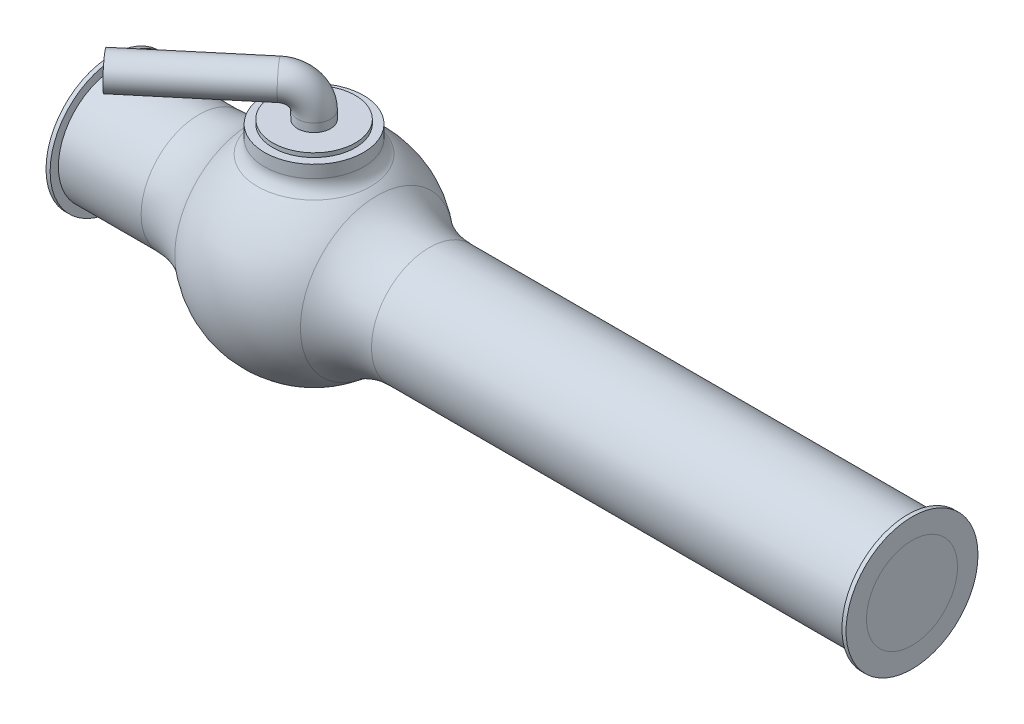
ISO-10303-21;
HEADER;
FILE_DESCRIPTION(('STEP AP214'),'2;1');
FILE_NAME('part.step','',(''),(''),'','','');
FILE_SCHEMA(('AUTOMOTIVE_DESIGN { 1 0 10303 214 1 1 1 1 }'));
ENDSEC;
DATA;
#1=APPLICATION_CONTEXT('core data for automotive mechanical design processes');
#2=APPLICATION_PROTOCOL_DEFINITION('international standard','automotive_design',2000,#1);
#3=PRODUCT_CONTEXT('',#1,'mechanical');
#4=PRODUCT('Part','Part','',(#3));
#5=PRODUCT_RELATED_PRODUCT_CATEGORY('part','',(#4));
#6=PRODUCT_DEFINITION_FORMATION('','',#4);
#7=PRODUCT_DEFINITION_CONTEXT('part definition',#1,'design');
#8=PRODUCT_DEFINITION('design','',#6,#7);
#9=PRODUCT_DEFINITION_SHAPE('','',#8);
#10=(LENGTH_UNIT() NAMED_UNIT(*) SI_UNIT(.MILLI.,.METRE.));
#11=(NAMED_UNIT(*) PLANE_ANGLE_UNIT() SI_UNIT($,.RADIAN.));
#12=(NAMED_UNIT(*) SI_UNIT($,.STERADIAN.) SOLID_ANGLE_UNIT());
#13=UNCERTAINTY_MEASURE_WITH_UNIT(LENGTH_MEASURE(1.E-05),#10,'distance_accuracy_value','');
#14=(GEOMETRIC_REPRESENTATION_CONTEXT(3) GLOBAL_UNCERTAINTY_ASSIGNED_CONTEXT((#13)) GLOBAL_UNIT_ASSIGNED_CONTEXT((#10,
#11,#12)) REPRESENTATION_CONTEXT('',''));
#15=CARTESIAN_POINT('',(0.,0.,0.));
#16=DIRECTION('',(0.,0.,1.));
#17=DIRECTION('',(1.,0.,0.));
#18=AXIS2_PLACEMENT_3D('',#15,#16,#17);
#19=CARTESIAN_POINT('',(0.,0.,0.));
#20=DIRECTION('',(0.,1.,0.));
#21=DIRECTION('',(0.,0.,-1.));
#22=AXIS2_PLACEMENT_3D('',#19,#20,#21);
#23=SPHERICAL_SURFACE('',#22,120.);
#24=CARTESIAN_POINT('',(0.,98.4782167977948,0.));
#25=DIRECTION('',(0.,-1.,0.));
#26=DIRECTION('',(0.,0.,-1.));
#27=AXIS2_PLACEMENT_3D('',#24,#25,#26);
#28=CIRCLE('',#27,68.5714285714286);
#29=CARTESIAN_POINT('',(0.,98.4782167977948,-68.5714285714286));
#30=VERTEX_POINT('',#29);
#31=EDGE_CURVE('P0_E11',#30,#30,#28,.T.);
#32=ORIENTED_EDGE('',*,*,#31,.T.);
#33=EDGE_LOOP('',(#32));
#34=FACE_BOUND('',#33,.T.);
#35=CARTESIAN_POINT('',(76.1685820569215,0.,0.));
#36=DIRECTION('',(-1.,0.,0.));
#37=DIRECTION('',(0.,0.,1.));
#38=AXIS2_PLACEMENT_3D('',#35,#36,#37);
#39=CIRCLE('',#38,92.7272727272727);
#40=CARTESIAN_POINT('',(76.1685820569215,0.,92.7272727272727));
#41=VERTEX_POINT('',#40);
#42=EDGE_CURVE('P0_E88',#41,#41,#39,.T.);
#43=ORIENTED_EDGE('',*,*,#42,.T.);
#44=EDGE_LOOP('',(#43));
#45=FACE_BOUND('',#44,.T.);
#46=CARTESIAN_POINT('',(-76.1685820569215,0.,0.));
#47=DIRECTION('',(1.,0.,0.));
#48=DIRECTION('',(0.,0.,-1.));
#49=AXIS2_PLACEMENT_3D('',#46,#47,#48);
#50=CIRCLE('',#49,92.7272727272727);
#51=CARTESIAN_POINT('',(-76.1685820569215,0.,-92.7272727272727));
#52=VERTEX_POINT('',#51);
#53=EDGE_CURVE('P0_E81',#52,#52,#50,.T.);
#54=ORIENTED_EDGE('',*,*,#53,.T.);
#55=EDGE_LOOP('',(#54));
#56=FACE_BOUND('',#55,.T.);
#57=ADVANCED_FACE('P0_F32',(#34,#45,#56),#23,.T.);
#58=CARTESIAN_POINT('',(0.,0.,0.));
#59=DIRECTION('',(0.,1.,0.));
#60=DIRECTION('',(0.,0.,-1.));
#61=AXIS2_PLACEMENT_3D('',#58,#59,#60);
#62=SPHERICAL_SURFACE('',#61,100.);
#63=CARTESIAN_POINT('',(-83.3885822273715,0.,0.));
#64=DIRECTION('',(1.,0.,0.));
#65=DIRECTION('',(0.,0.,-1.));
#66=AXIS2_PLACEMENT_3D('',#63,#64,#65);
#67=CIRCLE('',#66,55.1936985);
#68=CARTESIAN_POINT('',(-83.3885822273715,-46.099495348784,30.3509618084227));
#69=VERTEX_POINT('',#68);
#70=CARTESIAN_POINT('',(-83.3885822273715,46.0994953487841,30.3509618084227));
#71=VERTEX_POINT('',#70);
#72=EDGE_CURVE('P0_E46',#69,#71,#67,.F.);
#73=ORIENTED_EDGE('',*,*,#72,.T.);
#74=CARTESIAN_POINT('',(-63.879360034848,0.,53.6011474450814));
#75=DIRECTION('',(0.766044443118979,0.,-0.642787609686538));
#76=DIRECTION('',(-0.642787609686538,0.,-0.766044443118979));
#77=AXIS2_PLACEMENT_3D('',#74,#75,#76);
#78=CIRCLE('',#77,55.1936985);
#79=EDGE_CURVE('P0_E68',#71,#69,#78,.T.);
#80=ORIENTED_EDGE('',*,*,#79,.T.);
#81=EDGE_LOOP('',(#73,#80));
#82=FACE_BOUND('',#81,.T.);
#83=ADVANCED_FACE('P0_F76',(#82),#62,.F.);
#84=CARTESIAN_POINT('',(0.,135.,0.));
#85=DIRECTION('',(0.,1.,0.));
#86=DIRECTION('',(0.,0.,1.));
#87=AXIS2_PLACEMENT_3D('',#84,#85,#86);
#88=PLANE('',#87);
#89=CARTESIAN_POINT('',(0.,135.,0.));
#90=DIRECTION('',(0.,1.,0.));
#91=DIRECTION('',(0.,0.,1.));
#92=AXIS2_PLACEMENT_3D('',#89,#90,#91);
#93=CIRCLE('',#92,50.);
#94=CARTESIAN_POINT('',(0.,135.,50.));
#95=VERTEX_POINT('',#94);
#96=EDGE_CURVE('P0_E195',#95,#95,#93,.T.);
#97=ORIENTED_EDGE('',*,*,#96,.T.);
#98=EDGE_LOOP('',(#97));
#99=FACE_BOUND('',#98,.T.);
#100=CARTESIAN_POINT('',(0.,135.,0.));
#101=DIRECTION('',(0.,1.,0.));
#102=DIRECTION('',(0.,0.,1.));
#103=AXIS2_PLACEMENT_3D('',#100,#101,#102);
#104=CIRCLE('',#103,20.);
#105=CARTESIAN_POINT('',(0.,135.,20.));
#106=VERTEX_POINT('',#105);
#107=EDGE_CURVE('P0_E184',#106,#106,#104,.T.);
#108=ORIENTED_EDGE('',*,*,#107,.F.);
#109=EDGE_LOOP('',(#108));
#110=FACE_BOUND('',#109,.T.);
#111=ADVANCED_FACE('P0_F114',(#99,#110),#88,.T.);
#112=CARTESIAN_POINT('',(0.,135.,0.));
#113=DIRECTION('',(0.,-1.,0.));
#114=DIRECTION('',(0.,0.,-1.));
#115=AXIS2_PLACEMENT_3D('',#112,#113,#114);
#116=CYLINDRICAL_SURFACE('',#115,50.);
#117=ORIENTED_EDGE('',*,*,#96,.F.);
#118=EDGE_LOOP('',(#117));
#119=FACE_BOUND('',#118,.T.);
#120=CARTESIAN_POINT('',(0.,130.,0.));
#121=DIRECTION('',(0.,1.,0.));
#122=DIRECTION('',(0.,0.,1.));
#123=AXIS2_PLACEMENT_3D('',#120,#121,#122);
#124=CIRCLE('',#123,50.);
#125=CARTESIAN_POINT('',(0.,130.,50.));
#126=VERTEX_POINT('',#125);
#127=EDGE_CURVE('P0_E181',#126,#126,#124,.T.);
#128=ORIENTED_EDGE('',*,*,#127,.T.);
#129=EDGE_LOOP('',(#128));
#130=FACE_BOUND('',#129,.T.);
#131=ADVANCED_FACE('P0_F142',(#119,#130),#116,.T.);
#132=CARTESIAN_POINT('',(-22.9813332935695,175.,19.2836282905961));
#133=DIRECTION('',(-0.766044443118981,0.,0.642787609686535));
#134=DIRECTION('',(0.642787609686535,0.,0.766044443118982));
#135=AXIS2_PLACEMENT_3D('',#132,#133,#134);
#136=CYLINDRICAL_SURFACE('',#135,20.);
#137=CARTESIAN_POINT('',(-22.9813332935695,175.,19.2836282905961));
#138=DIRECTION('',(-0.766044443118982,0.,0.642787609686535));
#139=DIRECTION('',(0.492403876506103,-0.642787609686535,0.586824088833471));
#140=AXIS2_PLACEMENT_3D('',#137,#138,#139);
#141=CIRCLE('',#140,20.);
#142=CARTESIAN_POINT('',(-22.9813332935695,195.,19.2836282905961));
#143=VERTEX_POINT('',#142);
#144=EDGE_CURVE('P0_E188',#143,#143,#141,.T.);
#145=ORIENTED_EDGE('',*,*,#144,.T.);
#146=EDGE_LOOP('',(#145));
#147=FACE_BOUND('',#146,.T.);
#148=CARTESIAN_POINT('',(-137.887999761417,175.,115.701769743576));
#149=DIRECTION('',(-0.766044443118982,0.,0.642787609686535));
#150=DIRECTION('',(0.492403876506103,-0.642787609686535,0.586824088833471));
#151=AXIS2_PLACEMENT_3D('',#148,#149,#150);
#152=CIRCLE('',#151,20.);
#153=CARTESIAN_POINT('',(-128.039922231295,162.144247806269,127.438251520246));
#154=VERTEX_POINT('',#153);
#155=EDGE_CURVE('P0_E193',#154,#154,#152,.T.);
#156=ORIENTED_EDGE('',*,*,#155,.F.);
#157=EDGE_LOOP('',(#156));
#158=FACE_BOUND('',#157,.T.);
#159=ADVANCED_FACE('P0_F138',(#147,#158),#136,.T.);
#160=CARTESIAN_POINT('',(-22.9813332935694,145.,19.2836282905961));
#161=DIRECTION('',(0.642787609686535,0.,0.766044443118982));
#162=DIRECTION('',(0.766044443118982,0.,-0.642787609686535));
#163=AXIS2_PLACEMENT_3D('',#160,#161,#162);
#164=TOROIDAL_SURFACE('',#163,30.,20.);
#165=CARTESIAN_POINT('',(0.,145.,0.));
#166=DIRECTION('',(0.,1.,0.));
#167=DIRECTION('',(0.,0.,1.));
#168=AXIS2_PLACEMENT_3D('',#165,#166,#167);
#169=CIRCLE('',#168,20.);
#170=CARTESIAN_POINT('',(15.3208888623796,145.,-12.8557521937307));
#171=VERTEX_POINT('',#170);
#172=EDGE_CURVE('P0_E185',#171,#171,#169,.T.);
#173=CARTESIAN_POINT('',(-22.9813332935694,145.,19.2836282905961));
#174=DIRECTION('',(0.642787609686535,0.,0.766044443118982));
#175=DIRECTION('',(0.766044443118982,0.,-0.642787609686535));
#176=AXIS2_PLACEMENT_3D('',#173,#174,#175);
#177=CIRCLE('',#176,50.);
#178=EDGE_CURVE('',#171,#143,#177,.T.);
#179=ORIENTED_EDGE('',*,*,#172,.T.);
#180=ORIENTED_EDGE('',*,*,#144,.F.);
#181=ORIENTED_EDGE('',*,*,#178,.T.);
#182=ORIENTED_EDGE('',*,*,#178,.F.);
#183=EDGE_LOOP('',(#179,#181,#180,#182));
#184=FACE_BOUND('',#183,.T.);
#185=ADVANCED_FACE('P0_F134',(#184),#164,.T.);
#186=CARTESIAN_POINT('',(0.,145.,0.));
#187=DIRECTION('',(0.,-1.,0.));
#188=DIRECTION('',(0.,0.,-1.));
#189=AXIS2_PLACEMENT_3D('',#186,#187,#188);
#190=CYLINDRICAL_SURFACE('',#189,20.);
#191=ORIENTED_EDGE('',*,*,#172,.F.);
#192=EDGE_LOOP('',(#191));
#193=FACE_BOUND('',#192,.T.);
#194=ORIENTED_EDGE('',*,*,#107,.T.);
#195=EDGE_LOOP('',(#194));
#196=FACE_BOUND('',#195,.T.);
#197=ADVANCED_FACE('P0_F130',(#193,#196),#190,.T.);
#198=CARTESIAN_POINT('',(-137.887999761417,175.,115.701769743576));
#199=DIRECTION('',(-0.766044443118982,0.,0.642787609686535));
#200=DIRECTION('',(0.492403876506103,-0.642787609686535,0.586824088833471));
#201=AXIS2_PLACEMENT_3D('',#198,#199,#200);
#202=PLANE('',#201);
#203=ORIENTED_EDGE('',*,*,#155,.T.);
#204=EDGE_LOOP('',(#203));
#205=FACE_BOUND('',#204,.T.);
#206=ADVANCED_FACE('P0_F123',(#205),#202,.T.);
#207=CARTESIAN_POINT('',(0.,180.,0.));
#208=DIRECTION('',(0.,1.,0.));
#209=DIRECTION('',(0.,0.,1.));
#210=AXIS2_PLACEMENT_3D('',#207,#208,#209);
#211=CYLINDRICAL_SURFACE('',#210,60.);
#212=CARTESIAN_POINT('',(0.,114.891252930761,0.));
#213=DIRECTION('',(0.,-1.,0.));
#214=DIRECTION('',(0.,0.,-1.));
#215=AXIS2_PLACEMENT_3D('',#212,#213,#214);
#216=CIRCLE('',#215,60.);
#217=CARTESIAN_POINT('',(0.,114.891252930761,-60.));
#218=VERTEX_POINT('',#217);
#219=EDGE_CURVE('P0_E40',#218,#218,#216,.F.);
#220=ORIENTED_EDGE('',*,*,#219,.T.);
#221=EDGE_LOOP('',(#220));
#222=FACE_BOUND('',#221,.T.);
#223=CARTESIAN_POINT('',(0.,130.,0.));
#224=DIRECTION('',(0.,1.,0.));
#225=DIRECTION('',(0.,0.,1.));
#226=AXIS2_PLACEMENT_3D('',#223,#224,#225);
#227=CIRCLE('',#226,60.);
#228=CARTESIAN_POINT('',(0.,130.,60.));
#229=VERTEX_POINT('',#228);
#230=EDGE_CURVE('P0_E178',#229,#229,#227,.T.);
#231=ORIENTED_EDGE('',*,*,#230,.F.);
#232=EDGE_LOOP('',(#231));
#233=FACE_BOUND('',#232,.T.);
#234=ADVANCED_FACE('P0_F96',(#222,#233),#211,.T.);
#235=CARTESIAN_POINT('',(0.,130.,-40.));
#236=DIRECTION('',(0.,1.,0.));
#237=DIRECTION('',(0.,0.,1.));
#238=AXIS2_PLACEMENT_3D('',#235,#236,#237);
#239=PLANE('',#238);
#240=ORIENTED_EDGE('',*,*,#230,.T.);
#241=EDGE_LOOP('',(#240));
#242=FACE_BOUND('',#241,.T.);
#243=ORIENTED_EDGE('',*,*,#127,.F.);
#244=EDGE_LOOP('',(#243));
#245=FACE_BOUND('',#244,.T.);
#246=ADVANCED_FACE('P0_F122',(#242,#245),#239,.T.);
#247=CARTESIAN_POINT('',(-150.744751955147,0.,0.));
#248=DIRECTION('',(1.,0.,0.));
#249=DIRECTION('',(0.,0.,-1.));
#250=AXIS2_PLACEMENT_3D('',#247,#248,#249);
#251=CYLINDRICAL_SURFACE('',#250,70.);
#252=CARTESIAN_POINT('',(139.642400437689,0.,0.));
#253=DIRECTION('',(-1.,0.,0.));
#254=DIRECTION('',(0.,0.,1.));
#255=AXIS2_PLACEMENT_3D('',#252,#253,#254);
#256=CIRCLE('',#255,70.);
#257=CARTESIAN_POINT('',(139.642400437689,0.,70.));
#258=VERTEX_POINT('',#257);
#259=EDGE_CURVE('P0_E79',#258,#258,#256,.F.);
#260=ORIENTED_EDGE('',*,*,#259,.T.);
#261=EDGE_LOOP('',(#260));
#262=FACE_BOUND('',#261,.T.);
#263=CARTESIAN_POINT('',(720.,0.,0.));
#264=DIRECTION('',(1.,0.,0.));
#265=DIRECTION('',(0.,0.,-1.));
#266=AXIS2_PLACEMENT_3D('',#263,#264,#265);
#267=CIRCLE('',#266,70.);
#268=CARTESIAN_POINT('',(720.,0.,-70.));
#269=VERTEX_POINT('',#268);
#270=EDGE_CURVE('P0_E77',#269,#269,#267,.T.);
#271=ORIENTED_EDGE('',*,*,#270,.F.);
#272=EDGE_LOOP('',(#271));
#273=FACE_BOUND('',#272,.T.);
#274=ADVANCED_FACE('P0_F126',(#262,#273),#251,.T.);
#275=CARTESIAN_POINT('',(107.922796533957,0.,-90.5579787672637));
#276=DIRECTION('',(-0.766044443118979,0.,0.642787609686538));
#277=DIRECTION('',(0.642787609686538,0.,0.766044443118979));
#278=AXIS2_PLACEMENT_3D('',#275,#276,#277);
#279=CYLINDRICAL_SURFACE('',#278,55.1936985);
#280=CARTESIAN_POINT('',(63.879360034848,0.,-53.6011474450815));
#281=DIRECTION('',(-0.766044443118979,0.,0.642787609686538));
#282=DIRECTION('',(0.642787609686538,0.,0.766044443118979));
#283=AXIS2_PLACEMENT_3D('',#280,#281,#282);
#284=CIRCLE('',#283,55.1936985);
#285=CARTESIAN_POINT('',(83.3885822273715,46.0994953487841,-30.3509618084228));
#286=VERTEX_POINT('',#285);
#287=CARTESIAN_POINT('',(83.3885822273715,-46.0994953487841,-30.3509618084228));
#288=VERTEX_POINT('',#287);
#289=EDGE_CURVE('P0_E69',#286,#288,#284,.T.);
#290=ORIENTED_EDGE('',*,*,#289,.F.);
#291=EDGE_CURVE('P0_E197',#288,#286,#284,.T.);
#292=ORIENTED_EDGE('',*,*,#291,.F.);
#293=EDGE_LOOP('',(#290,#292));
#294=FACE_BOUND('',#293,.T.);
#295=ORIENTED_EDGE('',*,*,#79,.F.);
#296=EDGE_CURVE('P0_E62',#69,#71,#78,.T.);
#297=ORIENTED_EDGE('',*,*,#296,.F.);
#298=EDGE_LOOP('',(#295,#297));
#299=FACE_BOUND('',#298,.T.);
#300=ADVANCED_FACE('P0_F78',(#294,#299),#279,.F.);
#301=CARTESIAN_POINT('',(0.,0.,0.));
#302=DIRECTION('',(0.,1.,0.));
#303=DIRECTION('',(0.,0.,-1.));
#304=AXIS2_PLACEMENT_3D('',#301,#302,#303);
#305=SPHERICAL_SURFACE('',#304,100.);
#306=ORIENTED_EDGE('',*,*,#291,.T.);
#307=CARTESIAN_POINT('',(83.3885822273715,0.,0.));
#308=DIRECTION('',(-1.,0.,0.));
#309=DIRECTION('',(0.,0.,1.));
#310=AXIS2_PLACEMENT_3D('',#307,#308,#309);
#311=CIRCLE('',#310,55.1936985);
#312=EDGE_CURVE('P0_E173',#288,#286,#311,.T.);
#313=ORIENTED_EDGE('',*,*,#312,.F.);
#314=EDGE_LOOP('',(#306,#313));
#315=FACE_BOUND('',#314,.T.);
#316=ADVANCED_FACE('P0_F152',(#315),#305,.T.);
#317=ORIENTED_EDGE('',*,*,#289,.T.);
#318=EDGE_CURVE('P0_E53',#286,#288,#311,.T.);
#319=ORIENTED_EDGE('',*,*,#318,.F.);
#320=EDGE_LOOP('',(#317,#319));
#321=FACE_BOUND('',#320,.T.);
#322=ADVANCED_FACE('P0_F116',(#321),#62,.F.);
#323=CARTESIAN_POINT('',(-150.744751955147,0.,0.));
#324=DIRECTION('',(1.,0.,0.));
#325=DIRECTION('',(0.,0.,-1.));
#326=AXIS2_PLACEMENT_3D('',#323,#324,#325);
#327=CYLINDRICAL_SURFACE('',#326,55.1936985);
#328=ORIENTED_EDGE('',*,*,#318,.T.);
#329=ORIENTED_EDGE('',*,*,#312,.T.);
#330=EDGE_LOOP('',(#328,#329));
#331=FACE_BOUND('',#330,.T.);
#332=CARTESIAN_POINT('',(725.,0.,0.));
#333=DIRECTION('',(1.,0.,0.));
#334=DIRECTION('',(0.,0.,-1.));
#335=AXIS2_PLACEMENT_3D('',#332,#333,#334);
#336=CIRCLE('',#335,55.1936985);
#337=CARTESIAN_POINT('',(725.,0.,-55.1936985));
#338=VERTEX_POINT('',#337);
#339=EDGE_CURVE('P0_E258',#338,#338,#336,.T.);
#340=ORIENTED_EDGE('',*,*,#339,.T.);
#341=EDGE_LOOP('',(#340));
#342=FACE_BOUND('',#341,.T.);
#343=ADVANCED_FACE('P0_F205',(#331,#342),#327,.F.);
#344=CARTESIAN_POINT('',(0.,0.,0.));
#345=DIRECTION('',(0.,1.,0.));
#346=DIRECTION('',(0.,0.,-1.));
#347=AXIS2_PLACEMENT_3D('',#344,#345,#346);
#348=SPHERICAL_SURFACE('',#347,100.);
#349=ORIENTED_EDGE('',*,*,#296,.T.);
#350=EDGE_CURVE('P0_E64',#71,#69,#67,.F.);
#351=ORIENTED_EDGE('',*,*,#350,.T.);
#352=EDGE_LOOP('',(#349,#351));
#353=FACE_BOUND('',#352,.T.);
#354=ADVANCED_FACE('P0_F63',(#353),#348,.T.);
#355=CARTESIAN_POINT('',(720.001,0.,0.));
#356=DIRECTION('',(-1.,0.,0.));
#357=DIRECTION('',(0.,0.,1.));
#358=AXIS2_PLACEMENT_3D('',#355,#356,#357);
#359=CYLINDRICAL_SURFACE('',#358,55.1936985);
#360=ORIENTED_EDGE('',*,*,#72,.F.);
#361=ORIENTED_EDGE('',*,*,#350,.F.);
#362=EDGE_LOOP('',(#360,#361));
#363=FACE_BOUND('',#362,.T.);
#364=CARTESIAN_POINT('',(-245.,0.,0.));
#365=DIRECTION('',(-1.,0.,0.));
#366=DIRECTION('',(0.,0.,1.));
#367=AXIS2_PLACEMENT_3D('',#364,#365,#366);
#368=CIRCLE('',#367,55.1936985);
#369=CARTESIAN_POINT('',(-245.,0.,55.1936985));
#370=VERTEX_POINT('',#369);
#371=EDGE_CURVE('P0_E248',#370,#370,#368,.T.);
#372=ORIENTED_EDGE('',*,*,#371,.T.);
#373=EDGE_LOOP('',(#372));
#374=FACE_BOUND('',#373,.T.);
#375=ADVANCED_FACE('P0_F71',(#363,#374),#359,.F.);
#376=CARTESIAN_POINT('',(720.001,0.,0.));
#377=DIRECTION('',(-1.,0.,0.));
#378=DIRECTION('',(0.,0.,1.));
#379=AXIS2_PLACEMENT_3D('',#376,#377,#378);
#380=CYLINDRICAL_SURFACE('',#379,70.);
#381=CARTESIAN_POINT('',(-139.642400437689,0.,0.));
#382=DIRECTION('',(1.,0.,0.));
#383=DIRECTION('',(0.,0.,-1.));
#384=AXIS2_PLACEMENT_3D('',#381,#382,#383);
#385=CIRCLE('',#384,70.);
#386=CARTESIAN_POINT('',(-139.642400437689,0.,-70.));
#387=VERTEX_POINT('',#386);
#388=EDGE_CURVE('P0_E91',#387,#387,#385,.F.);
#389=ORIENTED_EDGE('',*,*,#388,.T.);
#390=EDGE_LOOP('',(#389));
#391=FACE_BOUND('',#390,.T.);
#392=CARTESIAN_POINT('',(-240.,0.,0.));
#393=DIRECTION('',(-1.,0.,0.));
#394=DIRECTION('',(0.,0.,1.));
#395=AXIS2_PLACEMENT_3D('',#392,#393,#394);
#396=CIRCLE('',#395,70.);
#397=CARTESIAN_POINT('',(-240.,0.,70.));
#398=VERTEX_POINT('',#397);
#399=EDGE_CURVE('P0_E254',#398,#398,#396,.T.);
#400=ORIENTED_EDGE('',*,*,#399,.F.);
#401=EDGE_LOOP('',(#400));
#402=FACE_BOUND('',#401,.T.);
#403=ADVANCED_FACE('P0_F219',(#391,#402),#380,.T.);
#404=CARTESIAN_POINT('',(725.,0.,0.));
#405=DIRECTION('',(1.,0.,0.));
#406=DIRECTION('',(0.,0.,-1.));
#407=AXIS2_PLACEMENT_3D('',#404,#405,#406);
#408=PLANE('',#407);
#409=CARTESIAN_POINT('',(725.,0.,0.));
#410=DIRECTION('',(1.,0.,0.));
#411=DIRECTION('',(0.,0.,-1.));
#412=AXIS2_PLACEMENT_3D('',#409,#410,#411);
#413=CIRCLE('',#412,80.);
#414=CARTESIAN_POINT('',(725.,0.,-80.));
#415=VERTEX_POINT('',#414);
#416=EDGE_CURVE('P0_E73',#415,#415,#413,.T.);
#417=ORIENTED_EDGE('',*,*,#416,.T.);
#418=EDGE_LOOP('',(#417));
#419=FACE_BOUND('',#418,.T.);
#420=ORIENTED_EDGE('',*,*,#339,.F.);
#421=EDGE_LOOP('',(#420));
#422=FACE_BOUND('',#421,.T.);
#423=ADVANCED_FACE('P0_F222',(#419,#422),#408,.T.);
#424=CARTESIAN_POINT('',(720.,0.,0.));
#425=DIRECTION('',(1.,0.,0.));
#426=DIRECTION('',(0.,0.,-1.));
#427=AXIS2_PLACEMENT_3D('',#424,#425,#426);
#428=PLANE('',#427);
#429=ORIENTED_EDGE('',*,*,#270,.T.);
#430=EDGE_LOOP('',(#429));
#431=FACE_BOUND('',#430,.T.);
#432=CARTESIAN_POINT('',(720.,0.,0.));
#433=DIRECTION('',(1.,0.,0.));
#434=DIRECTION('',(0.,0.,-1.));
#435=AXIS2_PLACEMENT_3D('',#432,#433,#434);
#436=CIRCLE('',#435,80.);
#437=CARTESIAN_POINT('',(720.,0.,-80.));
#438=VERTEX_POINT('',#437);
#439=EDGE_CURVE('P0_E261',#438,#438,#436,.T.);
#440=ORIENTED_EDGE('',*,*,#439,.F.);
#441=EDGE_LOOP('',(#440));
#442=FACE_BOUND('',#441,.T.);
#443=ADVANCED_FACE('P0_F228',(#431,#442),#428,.F.);
#444=CARTESIAN_POINT('',(725.,0.,0.));
#445=DIRECTION('',(-1.,0.,0.));
#446=DIRECTION('',(0.,0.,1.));
#447=AXIS2_PLACEMENT_3D('',#444,#445,#446);
#448=CYLINDRICAL_SURFACE('',#447,80.);
#449=ORIENTED_EDGE('',*,*,#416,.F.);
#450=EDGE_LOOP('',(#449));
#451=FACE_BOUND('',#450,.T.);
#452=ORIENTED_EDGE('',*,*,#439,.T.);
#453=EDGE_LOOP('',(#452));
#454=FACE_BOUND('',#453,.T.);
#455=ADVANCED_FACE('P0_F224',(#451,#454),#448,.T.);
#456=CARTESIAN_POINT('',(-240.,0.,0.));
#457=DIRECTION('',(-1.,0.,0.));
#458=DIRECTION('',(0.,0.,1.));
#459=AXIS2_PLACEMENT_3D('',#456,#457,#458);
#460=PLANE('',#459);
#461=CARTESIAN_POINT('',(-240.,0.,0.));
#462=DIRECTION('',(-1.,0.,0.));
#463=DIRECTION('',(0.,0.,1.));
#464=AXIS2_PLACEMENT_3D('',#461,#462,#463);
#465=CIRCLE('',#464,80.);
#466=CARTESIAN_POINT('',(-240.,0.,80.));
#467=VERTEX_POINT('',#466);
#468=EDGE_CURVE('P0_E249',#467,#467,#465,.T.);
#469=ORIENTED_EDGE('',*,*,#468,.F.);
#470=EDGE_LOOP('',(#469));
#471=FACE_BOUND('',#470,.T.);
#472=ORIENTED_EDGE('',*,*,#399,.T.);
#473=EDGE_LOOP('',(#472));
#474=FACE_BOUND('',#473,.T.);
#475=ADVANCED_FACE('P0_F227',(#471,#474),#460,.F.);
#476=CARTESIAN_POINT('',(-245.,0.,0.));
#477=DIRECTION('',(-1.,0.,0.));
#478=DIRECTION('',(0.,0.,1.));
#479=AXIS2_PLACEMENT_3D('',#476,#477,#478);
#480=PLANE('',#479);
#481=CARTESIAN_POINT('',(-245.,0.,0.));
#482=DIRECTION('',(-1.,0.,0.));
#483=DIRECTION('',(0.,0.,1.));
#484=AXIS2_PLACEMENT_3D('',#481,#482,#483);
#485=CIRCLE('',#484,80.);
#486=CARTESIAN_POINT('',(-245.,0.,80.));
#487=VERTEX_POINT('',#486);
#488=EDGE_CURVE('P0_E245',#487,#487,#485,.T.);
#489=ORIENTED_EDGE('',*,*,#488,.T.);
#490=EDGE_LOOP('',(#489));
#491=FACE_BOUND('',#490,.T.);
#492=ORIENTED_EDGE('',*,*,#371,.F.);
#493=EDGE_LOOP('',(#492));
#494=FACE_BOUND('',#493,.T.);
#495=ADVANCED_FACE('P0_F160',(#491,#494),#480,.T.);
#496=CARTESIAN_POINT('',(-245.,0.,0.));
#497=DIRECTION('',(1.,0.,0.));
#498=DIRECTION('',(0.,0.,-1.));
#499=AXIS2_PLACEMENT_3D('',#496,#497,#498);
#500=CYLINDRICAL_SURFACE('',#499,80.);
#501=ORIENTED_EDGE('',*,*,#488,.F.);
#502=EDGE_LOOP('',(#501));
#503=FACE_BOUND('',#502,.T.);
#504=ORIENTED_EDGE('',*,*,#468,.T.);
#505=EDGE_LOOP('',(#504));
#506=FACE_BOUND('',#505,.T.);
#507=ADVANCED_FACE('P0_F155',(#503,#506),#500,.T.);
#508=CARTESIAN_POINT('',(139.642400437689,0.,0.));
#509=DIRECTION('',(-1.,0.,0.));
#510=DIRECTION('',(0.,0.,1.));
#511=AXIS2_PLACEMENT_3D('',#508,#509,#510);
#512=TOROIDAL_SURFACE('',#511,170.,100.);
#513=ORIENTED_EDGE('',*,*,#42,.F.);
#514=EDGE_LOOP('',(#513));
#515=FACE_BOUND('',#514,.T.);
#516=ORIENTED_EDGE('',*,*,#259,.F.);
#517=EDGE_LOOP('',(#516));
#518=FACE_BOUND('',#517,.T.);
#519=ADVANCED_FACE('P0_F105',(#515,#518),#512,.F.);
#520=CARTESIAN_POINT('',(-139.642400437689,0.,0.));
#521=DIRECTION('',(1.,0.,0.));
#522=DIRECTION('',(0.,0.,-1.));
#523=AXIS2_PLACEMENT_3D('',#520,#521,#522);
#524=TOROIDAL_SURFACE('',#523,170.,100.);
#525=ORIENTED_EDGE('',*,*,#53,.F.);
#526=EDGE_LOOP('',(#525));
#527=FACE_BOUND('',#526,.T.);
#528=ORIENTED_EDGE('',*,*,#388,.F.);
#529=EDGE_LOOP('',(#528));
#530=FACE_BOUND('',#529,.T.);
#531=ADVANCED_FACE('P0_F100',(#527,#530),#524,.F.);
#532=CARTESIAN_POINT('',(0.,114.891252930761,0.));
#533=DIRECTION('',(0.,-1.,0.));
#534=DIRECTION('',(0.,0.,-1.));
#535=AXIS2_PLACEMENT_3D('',#532,#533,#534);
#536=TOROIDAL_SURFACE('',#535,80.,20.);
#537=ORIENTED_EDGE('',*,*,#31,.F.);
#538=EDGE_LOOP('',(#537));
#539=FACE_BOUND('',#538,.T.);
#540=ORIENTED_EDGE('',*,*,#219,.F.);
#541=EDGE_LOOP('',(#540));
#542=FACE_BOUND('',#541,.T.);
#543=ADVANCED_FACE('P0_F34',(#539,#542),#536,.F.);
#544=CLOSED_SHELL('',(#57,#83,#111,#131,#159,#185,#197,#206,#234,#246,#274,#300,#316,#322,#343,
#354,#375,#403,#423,#443,#455,#475,#495,#507,#519,#531,#543));
#545=MANIFOLD_SOLID_BREP('P0_B2',#544);
#546=CARTESIAN_POINT('',(-239.748482659427,0.,0.));
#547=DIRECTION('',(-1.,0.,0.));
#548=DIRECTION('',(0.,0.,1.));
#549=AXIS2_PLACEMENT_3D('',#546,#547,#548);
#550=CYLINDRICAL_SURFACE('',#549,55.1936985);
#551=CARTESIAN_POINT('',(-239.748482659427,0.,0.));
#552=DIRECTION('',(-1.,0.,0.));
#553=DIRECTION('',(0.,0.,1.));
#554=AXIS2_PLACEMENT_3D('',#551,#552,#553);
#555=CIRCLE('',#554,55.1936985);
#556=CARTESIAN_POINT('',(-239.748482659427,0.,55.1936985));
#557=VERTEX_POINT('',#556);
#558=EDGE_CURVE('P1_E10',#557,#557,#555,.T.);
#559=ORIENTED_EDGE('',*,*,#558,.T.);
#560=EDGE_LOOP('',(#559));
#561=FACE_BOUND('',#560,.T.);
#562=CARTESIAN_POINT('',(-245.,0.,0.));
#563=DIRECTION('',(-1.,0.,0.));
#564=DIRECTION('',(0.,0.,1.));
#565=AXIS2_PLACEMENT_3D('',#562,#563,#564);
#566=CIRCLE('',#565,55.1936985);
#567=CARTESIAN_POINT('',(-245.,0.,55.1936985));
#568=VERTEX_POINT('',#567);
#569=EDGE_CURVE('P1_E17',#568,#568,#566,.T.);
#570=ORIENTED_EDGE('',*,*,#569,.F.);
#571=EDGE_LOOP('',(#570));
#572=FACE_BOUND('',#571,.T.);
#573=ADVANCED_FACE('P1_F14',(#561,#572),#550,.T.);
#574=CARTESIAN_POINT('',(-239.748482659427,0.,-55.1936985));
#575=DIRECTION('',(-1.,0.,0.));
#576=DIRECTION('',(0.,-1.,0.));
#577=AXIS2_PLACEMENT_3D('',#574,#575,#576);
#578=PLANE('',#577);
#579=ORIENTED_EDGE('',*,*,#558,.F.);
#580=EDGE_LOOP('',(#579));
#581=FACE_BOUND('',#580,.T.);
#582=ADVANCED_FACE('P1_F29',(#581),#578,.F.);
#583=CARTESIAN_POINT('',(-245.,0.,-55.1936985));
#584=DIRECTION('',(-1.,0.,0.));
#585=DIRECTION('',(0.,-1.,0.));
#586=AXIS2_PLACEMENT_3D('',#583,#584,#585);
#587=PLANE('',#586);
#588=ORIENTED_EDGE('',*,*,#569,.T.);
#589=EDGE_LOOP('',(#588));
#590=FACE_BOUND('',#589,.T.);
#591=ADVANCED_FACE('P1_F26',(#590),#587,.T.);
#592=CLOSED_SHELL('',(#573,#582,#591));
#593=MANIFOLD_SOLID_BREP('P1_B1',#592);
#594=CARTESIAN_POINT('',(719.748482659427,0.,0.));
#595=DIRECTION('',(1.,0.,0.));
#596=DIRECTION('',(0.,0.,-1.));
#597=AXIS2_PLACEMENT_3D('',#594,#595,#596);
#598=CYLINDRICAL_SURFACE('',#597,55.1936985);
#599=CARTESIAN_POINT('',(719.748482659427,0.,0.));
#600=DIRECTION('',(1.,0.,0.));
#601=DIRECTION('',(0.,0.,-1.));
#602=AXIS2_PLACEMENT_3D('',#599,#600,#601);
#603=CIRCLE('',#602,55.1936985);
#604=CARTESIAN_POINT('',(719.748482659427,0.,-55.1936985));
#605=VERTEX_POINT('',#604);
#606=EDGE_CURVE('P2_E10',#605,#605,#603,.T.);
#607=ORIENTED_EDGE('',*,*,#606,.T.);
#608=EDGE_LOOP('',(#607));
#609=FACE_BOUND('',#608,.T.);
#610=CARTESIAN_POINT('',(725.,0.,0.));
#611=DIRECTION('',(1.,0.,0.));
#612=DIRECTION('',(0.,0.,-1.));
#613=AXIS2_PLACEMENT_3D('',#610,#611,#612);
#614=CIRCLE('',#613,55.1936985);
#615=CARTESIAN_POINT('',(725.,0.,-55.1936985));
#616=VERTEX_POINT('',#615);
#617=EDGE_CURVE('P2_E17',#616,#616,#614,.T.);
#618=ORIENTED_EDGE('',*,*,#617,.F.);
#619=EDGE_LOOP('',(#618));
#620=FACE_BOUND('',#619,.T.);
#621=ADVANCED_FACE('P2_F14',(#609,#620),#598,.T.);
#622=CARTESIAN_POINT('',(719.748482659427,0.,55.1936985));
#623=DIRECTION('',(1.,0.,0.));
#624=DIRECTION('',(0.,1.,0.));
#625=AXIS2_PLACEMENT_3D('',#622,#623,#624);
#626=PLANE('',#625);
#627=ORIENTED_EDGE('',*,*,#606,.F.);
#628=EDGE_LOOP('',(#627));
#629=FACE_BOUND('',#628,.T.);
#630=ADVANCED_FACE('P2_F29',(#629),#626,.F.);
#631=CARTESIAN_POINT('',(725.,0.,55.1936985));
#632=DIRECTION('',(1.,0.,0.));
#633=DIRECTION('',(0.,1.,0.));
#634=AXIS2_PLACEMENT_3D('',#631,#632,#633);
#635=PLANE('',#634);
#636=ORIENTED_EDGE('',*,*,#617,.T.);
#637=EDGE_LOOP('',(#636));
#638=FACE_BOUND('',#637,.T.);
#639=ADVANCED_FACE('P2_F26',(#638),#635,.T.);
#640=CLOSED_SHELL('',(#621,#630,#639));
#641=MANIFOLD_SOLID_BREP('P2_B1',#640);
#642=ADVANCED_BREP_SHAPE_REPRESENTATION('',(#18,#545,#593,#641),#14);
#643=SHAPE_DEFINITION_REPRESENTATION(#9,#642);
ENDSEC;
END-ISO-10303-21;
